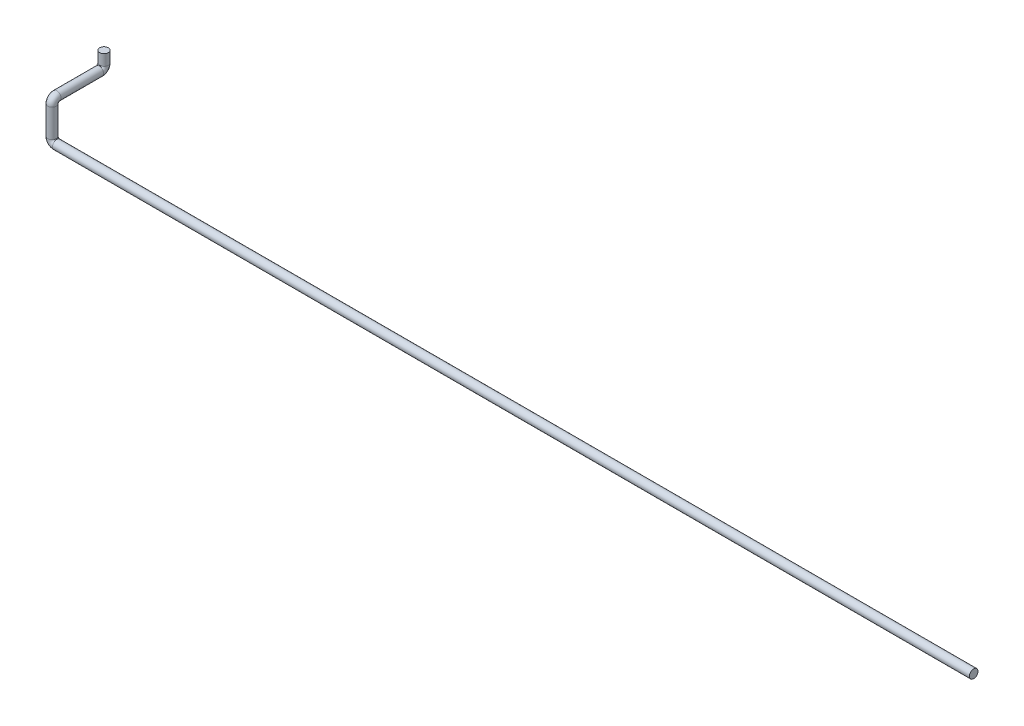
ISO-10303-21;
HEADER;
FILE_DESCRIPTION(('STEP AP214'),'2;1');
FILE_NAME('part.step','',(''),(''),'','','');
FILE_SCHEMA(('AUTOMOTIVE_DESIGN { 1 0 10303 214 1 1 1 1 }'));
ENDSEC;
DATA;
#1=APPLICATION_CONTEXT('core data for automotive mechanical design processes');
#2=APPLICATION_PROTOCOL_DEFINITION('international standard','automotive_design',2000,#1);
#3=PRODUCT_CONTEXT('',#1,'mechanical');
#4=PRODUCT('Part','Part','',(#3));
#5=PRODUCT_RELATED_PRODUCT_CATEGORY('part','',(#4));
#6=PRODUCT_DEFINITION_FORMATION('','',#4);
#7=PRODUCT_DEFINITION_CONTEXT('part definition',#1,'design');
#8=PRODUCT_DEFINITION('design','',#6,#7);
#9=PRODUCT_DEFINITION_SHAPE('','',#8);
#10=(LENGTH_UNIT() NAMED_UNIT(*) SI_UNIT(.MILLI.,.METRE.));
#11=(NAMED_UNIT(*) PLANE_ANGLE_UNIT() SI_UNIT($,.RADIAN.));
#12=(NAMED_UNIT(*) SI_UNIT($,.STERADIAN.) SOLID_ANGLE_UNIT());
#13=UNCERTAINTY_MEASURE_WITH_UNIT(LENGTH_MEASURE(1.E-05),#10,'distance_accuracy_value','');
#14=(GEOMETRIC_REPRESENTATION_CONTEXT(3) GLOBAL_UNCERTAINTY_ASSIGNED_CONTEXT((#13)) GLOBAL_UNIT_ASSIGNED_CONTEXT((#10,
#11,#12)) REPRESENTATION_CONTEXT('',''));
#15=CARTESIAN_POINT('',(0.,0.,0.));
#16=DIRECTION('',(0.,0.,1.));
#17=DIRECTION('',(1.,0.,0.));
#18=AXIS2_PLACEMENT_3D('',#15,#16,#17);
#19=CARTESIAN_POINT('',(0.,0.,0.));
#20=DIRECTION('',(1.,0.,0.));
#21=DIRECTION('',(0.,0.,-1.));
#22=AXIS2_PLACEMENT_3D('',#19,#20,#21);
#23=PLANE('',#22);
#24=CARTESIAN_POINT('',(0.,0.,0.));
#25=DIRECTION('',(1.,0.,0.));
#26=DIRECTION('',(0.,0.,-1.));
#27=AXIS2_PLACEMENT_3D('',#24,#25,#26);
#28=CIRCLE('',#27,13.7);
#29=CARTESIAN_POINT('',(0.,0.,-13.7));
#30=VERTEX_POINT('',#29);
#31=EDGE_CURVE('E46',#30,#30,#28,.T.);
#32=ORIENTED_EDGE('',*,*,#31,.T.);
#33=EDGE_LOOP('',(#32));
#34=FACE_BOUND('',#33,.T.);
#35=ADVANCED_FACE('F34',(#34),#23,.T.);
#36=CARTESIAN_POINT('',(-2945.,170.,-166.));
#37=DIRECTION('',(0.,-1.,0.));
#38=DIRECTION('',(0.,0.,-1.));
#39=AXIS2_PLACEMENT_3D('',#36,#37,#38);
#40=PLANE('',#39);
#41=CARTESIAN_POINT('',(-2945.,170.,-166.));
#42=DIRECTION('',(0.,-1.,0.));
#43=DIRECTION('',(0.,0.,-1.));
#44=AXIS2_PLACEMENT_3D('',#41,#42,#43);
#45=CIRCLE('',#44,13.7);
#46=CARTESIAN_POINT('',(-2945.,170.,-179.7));
#47=VERTEX_POINT('',#46);
#48=EDGE_CURVE('E11',#47,#47,#45,.T.);
#49=ORIENTED_EDGE('',*,*,#48,.F.);
#50=EDGE_LOOP('',(#49));
#51=FACE_BOUND('',#50,.T.);
#52=ADVANCED_FACE('F52',(#51),#40,.F.);
#53=CARTESIAN_POINT('',(0.,0.,0.));
#54=DIRECTION('',(-1.,0.,0.));
#55=DIRECTION('',(0.,0.,1.));
#56=AXIS2_PLACEMENT_3D('',#53,#54,#55);
#57=CYLINDRICAL_SURFACE('',#56,13.7);
#58=CARTESIAN_POINT('',(-2930.,0.,0.));
#59=DIRECTION('',(1.,0.,0.));
#60=DIRECTION('',(0.,0.,-1.));
#61=AXIS2_PLACEMENT_3D('',#58,#59,#60);
#62=CIRCLE('',#61,13.7);
#63=CARTESIAN_POINT('',(-2930.,-13.7000000000001,0.));
#64=VERTEX_POINT('',#63);
#65=EDGE_CURVE('E94',#64,#64,#62,.T.);
#66=ORIENTED_EDGE('',*,*,#65,.T.);
#67=EDGE_LOOP('',(#66));
#68=FACE_BOUND('',#67,.T.);
#69=ORIENTED_EDGE('',*,*,#31,.F.);
#70=EDGE_LOOP('',(#69));
#71=FACE_BOUND('',#70,.T.);
#72=ADVANCED_FACE('F54',(#68,#71),#57,.T.);
#73=CARTESIAN_POINT('',(-2930.,15.,0.));
#74=DIRECTION('',(0.,0.,-1.));
#75=DIRECTION('',(-1.,0.,0.));
#76=AXIS2_PLACEMENT_3D('',#73,#74,#75);
#77=TOROIDAL_SURFACE('',#76,15.0000000000001,13.7);
#78=CARTESIAN_POINT('',(-2945.,15.,0.));
#79=DIRECTION('',(0.,-1.,0.));
#80=DIRECTION('',(0.,0.,-1.));
#81=AXIS2_PLACEMENT_3D('',#78,#79,#80);
#82=CIRCLE('',#81,13.7);
#83=CARTESIAN_POINT('',(-2958.7,15.,0.));
#84=VERTEX_POINT('',#83);
#85=EDGE_CURVE('E91',#84,#84,#82,.T.);
#86=CARTESIAN_POINT('',(-2930.,15.,0.));
#87=DIRECTION('',(0.,0.,-1.));
#88=DIRECTION('',(-1.,0.,0.));
#89=AXIS2_PLACEMENT_3D('',#86,#87,#88);
#90=CIRCLE('',#89,28.7000000000001);
#91=EDGE_CURVE('',#64,#84,#90,.T.);
#92=ORIENTED_EDGE('',*,*,#65,.F.);
#93=ORIENTED_EDGE('',*,*,#85,.T.);
#94=ORIENTED_EDGE('',*,*,#91,.T.);
#95=ORIENTED_EDGE('',*,*,#91,.F.);
#96=EDGE_LOOP('',(#92,#94,#93,#95));
#97=FACE_BOUND('',#96,.T.);
#98=ADVANCED_FACE('F59',(#97),#77,.T.);
#99=CARTESIAN_POINT('',(-2945.,15.,0.));
#100=DIRECTION('',(0.,1.,0.));
#101=DIRECTION('',(0.,0.,1.));
#102=AXIS2_PLACEMENT_3D('',#99,#100,#101);
#103=CYLINDRICAL_SURFACE('',#102,13.7);
#104=CARTESIAN_POINT('',(-2945.,105.,0.));
#105=DIRECTION('',(0.,-1.,0.));
#106=DIRECTION('',(0.,0.,-1.));
#107=AXIS2_PLACEMENT_3D('',#104,#105,#106);
#108=CIRCLE('',#107,13.7);
#109=CARTESIAN_POINT('',(-2945.,105.,13.7));
#110=VERTEX_POINT('',#109);
#111=EDGE_CURVE('E96',#110,#110,#108,.T.);
#112=ORIENTED_EDGE('',*,*,#111,.T.);
#113=EDGE_LOOP('',(#112));
#114=FACE_BOUND('',#113,.T.);
#115=ORIENTED_EDGE('',*,*,#85,.F.);
#116=EDGE_LOOP('',(#115));
#117=FACE_BOUND('',#116,.T.);
#118=ADVANCED_FACE('F79',(#114,#117),#103,.T.);
#119=CARTESIAN_POINT('',(-2945.,105.,-15.));
#120=DIRECTION('',(-1.,0.,0.));
#121=DIRECTION('',(0.,0.,1.));
#122=AXIS2_PLACEMENT_3D('',#119,#120,#121);
#123=TOROIDAL_SURFACE('',#122,15.,13.7);
#124=CARTESIAN_POINT('',(-2945.,120.,-15.));
#125=DIRECTION('',(0.,0.,1.));
#126=DIRECTION('',(0.,-1.,0.));
#127=AXIS2_PLACEMENT_3D('',#124,#125,#126);
#128=CIRCLE('',#127,13.7);
#129=CARTESIAN_POINT('',(-2945.,133.7,-15.));
#130=VERTEX_POINT('',#129);
#131=EDGE_CURVE('E102',#130,#130,#128,.T.);
#132=CARTESIAN_POINT('',(-2945.,105.,-15.));
#133=DIRECTION('',(-1.,0.,0.));
#134=DIRECTION('',(0.,0.,1.));
#135=AXIS2_PLACEMENT_3D('',#132,#133,#134);
#136=CIRCLE('',#135,28.7);
#137=EDGE_CURVE('',#110,#130,#136,.T.);
#138=ORIENTED_EDGE('',*,*,#111,.F.);
#139=ORIENTED_EDGE('',*,*,#131,.T.);
#140=ORIENTED_EDGE('',*,*,#137,.T.);
#141=ORIENTED_EDGE('',*,*,#137,.F.);
#142=EDGE_LOOP('',(#138,#140,#139,#141));
#143=FACE_BOUND('',#142,.T.);
#144=ADVANCED_FACE('F75',(#143),#123,.T.);
#145=CARTESIAN_POINT('',(-2945.,120.,-15.));
#146=DIRECTION('',(0.,0.,-1.));
#147=DIRECTION('',(0.,1.,0.));
#148=AXIS2_PLACEMENT_3D('',#145,#146,#147);
#149=CYLINDRICAL_SURFACE('',#148,13.7);
#150=CARTESIAN_POINT('',(-2945.,120.,-151.));
#151=DIRECTION('',(0.,0.,1.));
#152=DIRECTION('',(0.,-1.,0.));
#153=AXIS2_PLACEMENT_3D('',#150,#151,#152);
#154=CIRCLE('',#153,13.7);
#155=CARTESIAN_POINT('',(-2945.,106.3,-151.));
#156=VERTEX_POINT('',#155);
#157=EDGE_CURVE('E105',#156,#156,#154,.T.);
#158=ORIENTED_EDGE('',*,*,#157,.T.);
#159=EDGE_LOOP('',(#158));
#160=FACE_BOUND('',#159,.T.);
#161=ORIENTED_EDGE('',*,*,#131,.F.);
#162=EDGE_LOOP('',(#161));
#163=FACE_BOUND('',#162,.T.);
#164=ADVANCED_FACE('F69',(#160,#163),#149,.T.);
#165=CARTESIAN_POINT('',(-2945.,135.,-151.));
#166=DIRECTION('',(1.,0.,0.));
#167=DIRECTION('',(0.,0.,-1.));
#168=AXIS2_PLACEMENT_3D('',#165,#166,#167);
#169=TOROIDAL_SURFACE('',#168,15.,13.7);
#170=CARTESIAN_POINT('',(-2945.,135.,-166.));
#171=DIRECTION('',(0.,-1.,0.));
#172=DIRECTION('',(0.,0.,-1.));
#173=AXIS2_PLACEMENT_3D('',#170,#171,#172);
#174=CIRCLE('',#173,13.7);
#175=CARTESIAN_POINT('',(-2945.,135.,-179.7));
#176=VERTEX_POINT('',#175);
#177=EDGE_CURVE('E41',#176,#176,#174,.T.);
#178=CARTESIAN_POINT('',(-2945.,135.,-151.));
#179=DIRECTION('',(1.,0.,0.));
#180=DIRECTION('',(0.,0.,-1.));
#181=AXIS2_PLACEMENT_3D('',#178,#179,#180);
#182=CIRCLE('',#181,28.7);
#183=EDGE_CURVE('',#156,#176,#182,.T.);
#184=ORIENTED_EDGE('',*,*,#157,.F.);
#185=ORIENTED_EDGE('',*,*,#177,.T.);
#186=ORIENTED_EDGE('',*,*,#183,.T.);
#187=ORIENTED_EDGE('',*,*,#183,.F.);
#188=EDGE_LOOP('',(#184,#186,#185,#187));
#189=FACE_BOUND('',#188,.T.);
#190=ADVANCED_FACE('F65',(#189),#169,.T.);
#191=CARTESIAN_POINT('',(-2945.,135.,-166.));
#192=DIRECTION('',(0.,1.,0.));
#193=DIRECTION('',(0.,0.,1.));
#194=AXIS2_PLACEMENT_3D('',#191,#192,#193);
#195=CYLINDRICAL_SURFACE('',#194,13.7);
#196=ORIENTED_EDGE('',*,*,#48,.T.);
#197=EDGE_LOOP('',(#196));
#198=FACE_BOUND('',#197,.T.);
#199=ORIENTED_EDGE('',*,*,#177,.F.);
#200=EDGE_LOOP('',(#199));
#201=FACE_BOUND('',#200,.T.);
#202=ADVANCED_FACE('F49',(#198,#201),#195,.T.);
#203=CLOSED_SHELL('',(#35,#52,#72,#98,#118,#144,#164,#190,#202));
#204=MANIFOLD_SOLID_BREP('B2',#203);
#205=ADVANCED_BREP_SHAPE_REPRESENTATION('',(#18,#204),#14);
#206=SHAPE_DEFINITION_REPRESENTATION(#9,#205);
ENDSEC;
END-ISO-10303-21;
